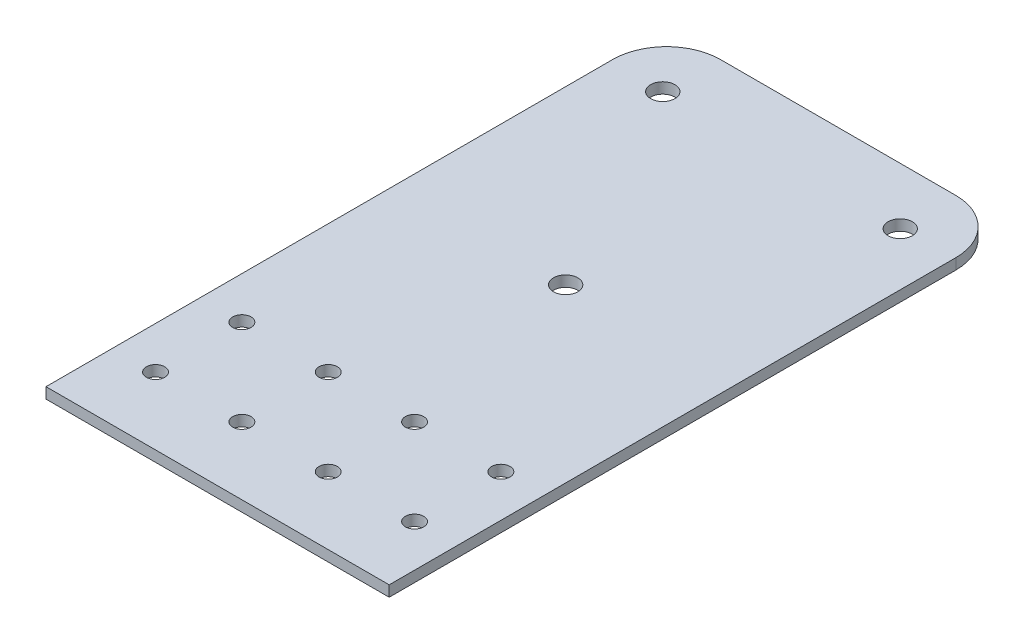
ISO-10303-21;
HEADER;
FILE_DESCRIPTION(('STEP AP214'),'2;1');
FILE_NAME('part.step','',(''),(''),'','','');
FILE_SCHEMA(('AUTOMOTIVE_DESIGN { 1 0 10303 214 1 1 1 1 }'));
ENDSEC;
DATA;
#1=APPLICATION_CONTEXT('core data for automotive mechanical design processes');
#2=APPLICATION_PROTOCOL_DEFINITION('international standard','automotive_design',2000,#1);
#3=PRODUCT_CONTEXT('',#1,'mechanical');
#4=PRODUCT('Part','Part','',(#3));
#5=PRODUCT_RELATED_PRODUCT_CATEGORY('part','',(#4));
#6=PRODUCT_DEFINITION_FORMATION('','',#4);
#7=PRODUCT_DEFINITION_CONTEXT('part definition',#1,'design');
#8=PRODUCT_DEFINITION('design','',#6,#7);
#9=PRODUCT_DEFINITION_SHAPE('','',#8);
#10=(LENGTH_UNIT() NAMED_UNIT(*) SI_UNIT(.MILLI.,.METRE.));
#11=(NAMED_UNIT(*) PLANE_ANGLE_UNIT() SI_UNIT($,.RADIAN.));
#12=(NAMED_UNIT(*) SI_UNIT($,.STERADIAN.) SOLID_ANGLE_UNIT());
#13=UNCERTAINTY_MEASURE_WITH_UNIT(LENGTH_MEASURE(1.E-05),#10,'distance_accuracy_value','');
#14=(GEOMETRIC_REPRESENTATION_CONTEXT(3) GLOBAL_UNCERTAINTY_ASSIGNED_CONTEXT((#13)) GLOBAL_UNIT_ASSIGNED_CONTEXT((#10,
#11,#12)) REPRESENTATION_CONTEXT('',''));
#15=CARTESIAN_POINT('',(0.,0.,0.));
#16=DIRECTION('',(0.,0.,1.));
#17=DIRECTION('',(1.,0.,0.));
#18=AXIS2_PLACEMENT_3D('',#15,#16,#17);
#19=CARTESIAN_POINT('',(31.8,0.,0.));
#20=DIRECTION('',(0.,0.,1.));
#21=DIRECTION('',(1.,0.,0.));
#22=AXIS2_PLACEMENT_3D('',#19,#20,#21);
#23=PLANE('',#22);
#24=DIRECTION('',(-1.,0.,0.));
#25=VECTOR('',#24,1.);
#26=CARTESIAN_POINT('',(31.8,2.,0.));
#27=LINE('',#26,#25);
#28=CARTESIAN_POINT('',(21.8,2.,0.));
#29=VERTEX_POINT('',#28);
#30=CARTESIAN_POINT('',(-21.8,2.,0.));
#31=VERTEX_POINT('',#30);
#32=EDGE_CURVE('E109',#29,#31,#27,.T.);
#33=ORIENTED_EDGE('',*,*,#32,.F.);
#34=DIRECTION('',(0.,1.,0.));
#35=VECTOR('',#34,1.);
#36=CARTESIAN_POINT('',(21.8,0.,0.));
#37=LINE('',#36,#35);
#38=CARTESIAN_POINT('',(21.8,0.,0.));
#39=VERTEX_POINT('',#38);
#40=EDGE_CURVE('E141',#29,#39,#37,.F.);
#41=ORIENTED_EDGE('',*,*,#40,.T.);
#42=DIRECTION('',(-1.,0.,0.));
#43=VECTOR('',#42,1.);
#44=CARTESIAN_POINT('',(31.8,0.,0.));
#45=LINE('',#44,#43);
#46=CARTESIAN_POINT('',(-21.8,0.,0.));
#47=VERTEX_POINT('',#46);
#48=EDGE_CURVE('E126',#39,#47,#45,.T.);
#49=ORIENTED_EDGE('',*,*,#48,.T.);
#50=DIRECTION('',(0.,1.,0.));
#51=VECTOR('',#50,1.);
#52=CARTESIAN_POINT('',(-21.8,0.,0.));
#53=LINE('',#52,#51);
#54=EDGE_CURVE('E138',#47,#31,#53,.T.);
#55=ORIENTED_EDGE('',*,*,#54,.T.);
#56=EDGE_LOOP('',(#33,#41,#49,#55));
#57=FACE_BOUND('',#56,.T.);
#58=ADVANCED_FACE('F36',(#57),#23,.F.);
#59=CARTESIAN_POINT('',(31.8,1.99999999999999,55.));
#60=DIRECTION('',(0.,-1.,0.));
#61=DIRECTION('',(0.,0.,-1.));
#62=AXIS2_PLACEMENT_3D('',#59,#60,#61);
#63=PLANE('',#62);
#64=CARTESIAN_POINT('',(0.,1.99999999999999,50.5));
#65=DIRECTION('',(0.,1.,0.));
#66=DIRECTION('',(0.,0.,1.));
#67=AXIS2_PLACEMENT_3D('',#64,#65,#66);
#68=CIRCLE('',#67,2.25);
#69=CARTESIAN_POINT('',(0.,1.99999999999999,52.75));
#70=VERTEX_POINT('',#69);
#71=EDGE_CURVE('E310',#70,#70,#68,.T.);
#72=ORIENTED_EDGE('',*,*,#71,.F.);
#73=EDGE_LOOP('',(#72));
#74=FACE_BOUND('',#73,.T.);
#75=CARTESIAN_POINT('',(22.,2.,10.5));
#76=DIRECTION('',(0.,1.,0.));
#77=DIRECTION('',(0.,0.,1.));
#78=AXIS2_PLACEMENT_3D('',#75,#76,#77);
#79=CIRCLE('',#78,2.25);
#80=CARTESIAN_POINT('',(22.,2.,12.75));
#81=VERTEX_POINT('',#80);
#82=EDGE_CURVE('E132',#81,#81,#79,.T.);
#83=ORIENTED_EDGE('',*,*,#82,.F.);
#84=EDGE_LOOP('',(#83));
#85=FACE_BOUND('',#84,.T.);
#86=CARTESIAN_POINT('',(-22.,2.,10.5));
#87=DIRECTION('',(0.,1.,0.));
#88=DIRECTION('',(0.,0.,1.));
#89=AXIS2_PLACEMENT_3D('',#86,#87,#88);
#90=CIRCLE('',#89,2.25);
#91=CARTESIAN_POINT('',(-22.,2.,12.75));
#92=VERTEX_POINT('',#91);
#93=EDGE_CURVE('E131',#92,#92,#90,.T.);
#94=ORIENTED_EDGE('',*,*,#93,.F.);
#95=EDGE_LOOP('',(#94));
#96=FACE_BOUND('',#95,.T.);
#97=CARTESIAN_POINT('',(-24.,1.99999999999999,102.5));
#98=DIRECTION('',(0.,1.,0.));
#99=DIRECTION('',(0.,0.,1.));
#100=AXIS2_PLACEMENT_3D('',#97,#98,#99);
#101=CIRCLE('',#100,1.69999999999999);
#102=CARTESIAN_POINT('',(-24.,1.99999999999999,104.2));
#103=VERTEX_POINT('',#102);
#104=EDGE_CURVE('E301',#103,#103,#101,.T.);
#105=ORIENTED_EDGE('',*,*,#104,.F.);
#106=EDGE_LOOP('',(#105));
#107=FACE_BOUND('',#106,.T.);
#108=CARTESIAN_POINT('',(-24.,1.99999999999999,86.5));
#109=DIRECTION('',(0.,1.,0.));
#110=DIRECTION('',(0.,0.,1.));
#111=AXIS2_PLACEMENT_3D('',#108,#109,#110);
#112=CIRCLE('',#111,1.69999999999999);
#113=CARTESIAN_POINT('',(-24.,1.99999999999999,88.2));
#114=VERTEX_POINT('',#113);
#115=EDGE_CURVE('E297',#114,#114,#112,.T.);
#116=ORIENTED_EDGE('',*,*,#115,.F.);
#117=EDGE_LOOP('',(#116));
#118=FACE_BOUND('',#117,.T.);
#119=CARTESIAN_POINT('',(-8.,1.99999999999999,86.5));
#120=DIRECTION('',(0.,1.,0.));
#121=DIRECTION('',(0.,0.,1.));
#122=AXIS2_PLACEMENT_3D('',#119,#120,#121);
#123=CIRCLE('',#122,1.69999999999999);
#124=CARTESIAN_POINT('',(-8.,1.99999999999999,88.2));
#125=VERTEX_POINT('',#124);
#126=EDGE_CURVE('E293',#125,#125,#123,.T.);
#127=ORIENTED_EDGE('',*,*,#126,.F.);
#128=EDGE_LOOP('',(#127));
#129=FACE_BOUND('',#128,.T.);
#130=CARTESIAN_POINT('',(-8.,1.99999999999999,102.5));
#131=DIRECTION('',(0.,1.,0.));
#132=DIRECTION('',(0.,0.,1.));
#133=AXIS2_PLACEMENT_3D('',#130,#131,#132);
#134=CIRCLE('',#133,1.69999999999999);
#135=CARTESIAN_POINT('',(-8.,1.99999999999999,104.2));
#136=VERTEX_POINT('',#135);
#137=EDGE_CURVE('E289',#136,#136,#134,.T.);
#138=ORIENTED_EDGE('',*,*,#137,.F.);
#139=EDGE_LOOP('',(#138));
#140=FACE_BOUND('',#139,.T.);
#141=CARTESIAN_POINT('',(24.,1.99999999999999,102.5));
#142=DIRECTION('',(0.,1.,0.));
#143=DIRECTION('',(0.,0.,1.));
#144=AXIS2_PLACEMENT_3D('',#141,#142,#143);
#145=CIRCLE('',#144,1.69999999999999);
#146=CARTESIAN_POINT('',(24.,1.99999999999999,104.2));
#147=VERTEX_POINT('',#146);
#148=EDGE_CURVE('E285',#147,#147,#145,.T.);
#149=ORIENTED_EDGE('',*,*,#148,.F.);
#150=EDGE_LOOP('',(#149));
#151=FACE_BOUND('',#150,.T.);
#152=CARTESIAN_POINT('',(8.,1.99999999999999,102.5));
#153=DIRECTION('',(0.,1.,0.));
#154=DIRECTION('',(0.,0.,1.));
#155=AXIS2_PLACEMENT_3D('',#152,#153,#154);
#156=CIRCLE('',#155,1.69999999999999);
#157=CARTESIAN_POINT('',(8.,1.99999999999999,104.2));
#158=VERTEX_POINT('',#157);
#159=EDGE_CURVE('E280',#158,#158,#156,.T.);
#160=ORIENTED_EDGE('',*,*,#159,.F.);
#161=EDGE_LOOP('',(#160));
#162=FACE_BOUND('',#161,.T.);
#163=CARTESIAN_POINT('',(8.,1.99999999999999,86.5));
#164=DIRECTION('',(0.,1.,0.));
#165=DIRECTION('',(0.,0.,1.));
#166=AXIS2_PLACEMENT_3D('',#163,#164,#165);
#167=CIRCLE('',#166,1.69999999999999);
#168=CARTESIAN_POINT('',(8.,1.99999999999999,88.2));
#169=VERTEX_POINT('',#168);
#170=EDGE_CURVE('E225',#169,#169,#167,.T.);
#171=ORIENTED_EDGE('',*,*,#170,.F.);
#172=EDGE_LOOP('',(#171));
#173=FACE_BOUND('',#172,.T.);
#174=CARTESIAN_POINT('',(24.,1.99999999999999,86.5));
#175=DIRECTION('',(0.,1.,0.));
#176=DIRECTION('',(0.,0.,1.));
#177=AXIS2_PLACEMENT_3D('',#174,#175,#176);
#178=CIRCLE('',#177,1.69999999999999);
#179=CARTESIAN_POINT('',(24.,1.99999999999999,88.2));
#180=VERTEX_POINT('',#179);
#181=EDGE_CURVE('E230',#180,#180,#178,.T.);
#182=ORIENTED_EDGE('',*,*,#181,.F.);
#183=EDGE_LOOP('',(#182));
#184=FACE_BOUND('',#183,.T.);
#185=DIRECTION('',(0.,0.,1.));
#186=VECTOR('',#185,1.);
#187=CARTESIAN_POINT('',(31.8,2.,0.));
#188=LINE('',#187,#186);
#189=CARTESIAN_POINT('',(31.8,2.,10.));
#190=VERTEX_POINT('',#189);
#191=CARTESIAN_POINT('',(31.8,1.99999999999999,115.));
#192=VERTEX_POINT('',#191);
#193=EDGE_CURVE('E90',#190,#192,#188,.T.);
#194=ORIENTED_EDGE('',*,*,#193,.F.);
#195=CARTESIAN_POINT('',(21.8,2.,10.));
#196=DIRECTION('',(0.,-1.,0.));
#197=DIRECTION('',(0.,0.,-1.));
#198=AXIS2_PLACEMENT_3D('',#195,#196,#197);
#199=CIRCLE('',#198,10.);
#200=EDGE_CURVE('E136',#190,#29,#199,.F.);
#201=ORIENTED_EDGE('',*,*,#200,.T.);
#202=ORIENTED_EDGE('',*,*,#32,.T.);
#203=CARTESIAN_POINT('',(-21.8,2.,10.));
#204=DIRECTION('',(0.,-1.,0.));
#205=DIRECTION('',(0.,0.,-1.));
#206=AXIS2_PLACEMENT_3D('',#203,#204,#205);
#207=CIRCLE('',#206,10.);
#208=CARTESIAN_POINT('',(-31.8,2.,10.));
#209=VERTEX_POINT('',#208);
#210=EDGE_CURVE('E134',#31,#209,#207,.F.);
#211=ORIENTED_EDGE('',*,*,#210,.T.);
#212=DIRECTION('',(0.,0.,1.));
#213=VECTOR('',#212,1.);
#214=CARTESIAN_POINT('',(-31.8,1.99999999999999,55.));
#215=LINE('',#214,#213);
#216=CARTESIAN_POINT('',(-31.8,1.99999999999999,115.));
#217=VERTEX_POINT('',#216);
#218=EDGE_CURVE('E105',#209,#217,#215,.T.);
#219=ORIENTED_EDGE('',*,*,#218,.T.);
#220=DIRECTION('',(-1.,0.,0.));
#221=VECTOR('',#220,1.);
#222=CARTESIAN_POINT('',(31.8,1.99999999999999,115.));
#223=LINE('',#222,#221);
#224=EDGE_CURVE('E103',#192,#217,#223,.T.);
#225=ORIENTED_EDGE('',*,*,#224,.F.);
#226=EDGE_LOOP('',(#194,#201,#202,#211,#219,#225));
#227=FACE_BOUND('',#226,.T.);
#228=ADVANCED_FACE('F104',(#74,#85,#96,#107,#118,#129,#140,#151,#162,#173,#184,#227),#63,.F.);
#229=CARTESIAN_POINT('',(31.8,1.99999999999999,115.));
#230=DIRECTION('',(0.,0.,-1.));
#231=DIRECTION('',(-1.,0.,0.));
#232=AXIS2_PLACEMENT_3D('',#229,#230,#231);
#233=PLANE('',#232);
#234=DIRECTION('',(0.,-1.,0.));
#235=VECTOR('',#234,1.);
#236=CARTESIAN_POINT('',(-31.8,1.99999999999999,115.));
#237=LINE('',#236,#235);
#238=CARTESIAN_POINT('',(-31.8,0.,115.));
#239=VERTEX_POINT('',#238);
#240=EDGE_CURVE('E119',#217,#239,#237,.T.);
#241=ORIENTED_EDGE('',*,*,#240,.T.);
#242=DIRECTION('',(-1.,0.,0.));
#243=VECTOR('',#242,1.);
#244=CARTESIAN_POINT('',(31.8,0.,115.));
#245=LINE('',#244,#243);
#246=CARTESIAN_POINT('',(31.8,0.,115.));
#247=VERTEX_POINT('',#246);
#248=EDGE_CURVE('E110',#247,#239,#245,.T.);
#249=ORIENTED_EDGE('',*,*,#248,.F.);
#250=DIRECTION('',(0.,-1.,0.));
#251=VECTOR('',#250,1.);
#252=CARTESIAN_POINT('',(31.8,1.99999999999999,115.));
#253=LINE('',#252,#251);
#254=EDGE_CURVE('E95',#192,#247,#253,.T.);
#255=ORIENTED_EDGE('',*,*,#254,.F.);
#256=ORIENTED_EDGE('',*,*,#224,.T.);
#257=EDGE_LOOP('',(#241,#249,#255,#256));
#258=FACE_BOUND('',#257,.T.);
#259=ADVANCED_FACE('F112',(#258),#233,.F.);
#260=CARTESIAN_POINT('',(31.8,0.,35.));
#261=DIRECTION('',(0.,1.,0.));
#262=DIRECTION('',(0.,0.,1.));
#263=AXIS2_PLACEMENT_3D('',#260,#261,#262);
#264=PLANE('',#263);
#265=CARTESIAN_POINT('',(0.,0.,50.5));
#266=DIRECTION('',(0.,1.,0.));
#267=DIRECTION('',(0.,0.,1.));
#268=AXIS2_PLACEMENT_3D('',#265,#266,#267);
#269=CIRCLE('',#268,2.25);
#270=CARTESIAN_POINT('',(0.,0.,52.75));
#271=VERTEX_POINT('',#270);
#272=EDGE_CURVE('E250',#271,#271,#269,.T.);
#273=ORIENTED_EDGE('',*,*,#272,.T.);
#274=EDGE_LOOP('',(#273));
#275=FACE_BOUND('',#274,.T.);
#276=CARTESIAN_POINT('',(22.,0.,10.5));
#277=DIRECTION('',(0.,1.,0.));
#278=DIRECTION('',(0.,0.,1.));
#279=AXIS2_PLACEMENT_3D('',#276,#277,#278);
#280=CIRCLE('',#279,2.25);
#281=CARTESIAN_POINT('',(22.,0.,12.75));
#282=VERTEX_POINT('',#281);
#283=EDGE_CURVE('E128',#282,#282,#280,.T.);
#284=ORIENTED_EDGE('',*,*,#283,.T.);
#285=EDGE_LOOP('',(#284));
#286=FACE_BOUND('',#285,.T.);
#287=CARTESIAN_POINT('',(-22.,0.,10.5));
#288=DIRECTION('',(0.,1.,0.));
#289=DIRECTION('',(0.,0.,1.));
#290=AXIS2_PLACEMENT_3D('',#287,#288,#289);
#291=CIRCLE('',#290,2.25);
#292=CARTESIAN_POINT('',(-22.,0.,12.75));
#293=VERTEX_POINT('',#292);
#294=EDGE_CURVE('E256',#293,#293,#291,.T.);
#295=ORIENTED_EDGE('',*,*,#294,.T.);
#296=EDGE_LOOP('',(#295));
#297=FACE_BOUND('',#296,.T.);
#298=CARTESIAN_POINT('',(-24.,0.,102.5));
#299=DIRECTION('',(0.,1.,0.));
#300=DIRECTION('',(0.,0.,1.));
#301=AXIS2_PLACEMENT_3D('',#298,#299,#300);
#302=CIRCLE('',#301,1.69999999999999);
#303=CARTESIAN_POINT('',(-24.,0.,104.2));
#304=VERTEX_POINT('',#303);
#305=EDGE_CURVE('E260',#304,#304,#302,.T.);
#306=ORIENTED_EDGE('',*,*,#305,.T.);
#307=EDGE_LOOP('',(#306));
#308=FACE_BOUND('',#307,.T.);
#309=CARTESIAN_POINT('',(-24.,0.,86.5));
#310=DIRECTION('',(0.,1.,0.));
#311=DIRECTION('',(0.,0.,1.));
#312=AXIS2_PLACEMENT_3D('',#309,#310,#311);
#313=CIRCLE('',#312,1.69999999999999);
#314=CARTESIAN_POINT('',(-24.,0.,88.2));
#315=VERTEX_POINT('',#314);
#316=EDGE_CURVE('E264',#315,#315,#313,.T.);
#317=ORIENTED_EDGE('',*,*,#316,.T.);
#318=EDGE_LOOP('',(#317));
#319=FACE_BOUND('',#318,.T.);
#320=CARTESIAN_POINT('',(-8.,0.,86.5));
#321=DIRECTION('',(0.,1.,0.));
#322=DIRECTION('',(0.,0.,1.));
#323=AXIS2_PLACEMENT_3D('',#320,#321,#322);
#324=CIRCLE('',#323,1.69999999999999);
#325=CARTESIAN_POINT('',(-8.,0.,88.2));
#326=VERTEX_POINT('',#325);
#327=EDGE_CURVE('E268',#326,#326,#324,.T.);
#328=ORIENTED_EDGE('',*,*,#327,.T.);
#329=EDGE_LOOP('',(#328));
#330=FACE_BOUND('',#329,.T.);
#331=CARTESIAN_POINT('',(-8.,0.,102.5));
#332=DIRECTION('',(0.,1.,0.));
#333=DIRECTION('',(0.,0.,1.));
#334=AXIS2_PLACEMENT_3D('',#331,#332,#333);
#335=CIRCLE('',#334,1.69999999999999);
#336=CARTESIAN_POINT('',(-8.,0.,104.2));
#337=VERTEX_POINT('',#336);
#338=EDGE_CURVE('E272',#337,#337,#335,.T.);
#339=ORIENTED_EDGE('',*,*,#338,.T.);
#340=EDGE_LOOP('',(#339));
#341=FACE_BOUND('',#340,.T.);
#342=CARTESIAN_POINT('',(24.,0.,102.5));
#343=DIRECTION('',(0.,1.,0.));
#344=DIRECTION('',(0.,0.,1.));
#345=AXIS2_PLACEMENT_3D('',#342,#343,#344);
#346=CIRCLE('',#345,1.69999999999999);
#347=CARTESIAN_POINT('',(24.,0.,104.2));
#348=VERTEX_POINT('',#347);
#349=EDGE_CURVE('E276',#348,#348,#346,.T.);
#350=ORIENTED_EDGE('',*,*,#349,.T.);
#351=EDGE_LOOP('',(#350));
#352=FACE_BOUND('',#351,.T.);
#353=CARTESIAN_POINT('',(8.,0.,102.5));
#354=DIRECTION('',(0.,1.,0.));
#355=DIRECTION('',(0.,0.,1.));
#356=AXIS2_PLACEMENT_3D('',#353,#354,#355);
#357=CIRCLE('',#356,1.69999999999999);
#358=CARTESIAN_POINT('',(8.,0.,104.2));
#359=VERTEX_POINT('',#358);
#360=EDGE_CURVE('E234',#359,#359,#357,.T.);
#361=ORIENTED_EDGE('',*,*,#360,.T.);
#362=EDGE_LOOP('',(#361));
#363=FACE_BOUND('',#362,.T.);
#364=CARTESIAN_POINT('',(8.,0.,86.5));
#365=DIRECTION('',(0.,1.,0.));
#366=DIRECTION('',(0.,0.,1.));
#367=AXIS2_PLACEMENT_3D('',#364,#365,#366);
#368=CIRCLE('',#367,1.69999999999999);
#369=CARTESIAN_POINT('',(8.,0.,88.2));
#370=VERTEX_POINT('',#369);
#371=EDGE_CURVE('E228',#370,#370,#368,.T.);
#372=ORIENTED_EDGE('',*,*,#371,.T.);
#373=EDGE_LOOP('',(#372));
#374=FACE_BOUND('',#373,.T.);
#375=CARTESIAN_POINT('',(24.,0.,86.5));
#376=DIRECTION('',(0.,1.,0.));
#377=DIRECTION('',(0.,0.,1.));
#378=AXIS2_PLACEMENT_3D('',#375,#376,#377);
#379=CIRCLE('',#378,1.69999999999999);
#380=CARTESIAN_POINT('',(24.,0.,88.2));
#381=VERTEX_POINT('',#380);
#382=EDGE_CURVE('E120',#381,#381,#379,.T.);
#383=ORIENTED_EDGE('',*,*,#382,.T.);
#384=EDGE_LOOP('',(#383));
#385=FACE_BOUND('',#384,.T.);
#386=ORIENTED_EDGE('',*,*,#48,.F.);
#387=CARTESIAN_POINT('',(21.8,0.,10.));
#388=DIRECTION('',(0.,1.,0.));
#389=DIRECTION('',(0.,0.,1.));
#390=AXIS2_PLACEMENT_3D('',#387,#388,#389);
#391=CIRCLE('',#390,10.);
#392=CARTESIAN_POINT('',(31.8,0.,10.));
#393=VERTEX_POINT('',#392);
#394=EDGE_CURVE('E44',#39,#393,#391,.F.);
#395=ORIENTED_EDGE('',*,*,#394,.T.);
#396=DIRECTION('',(0.,0.,-1.));
#397=VECTOR('',#396,1.);
#398=CARTESIAN_POINT('',(31.8,0.,0.));
#399=LINE('',#398,#397);
#400=EDGE_CURVE('E100',#247,#393,#399,.T.);
#401=ORIENTED_EDGE('',*,*,#400,.F.);
#402=ORIENTED_EDGE('',*,*,#248,.T.);
#403=DIRECTION('',(0.,0.,-1.));
#404=VECTOR('',#403,1.);
#405=CARTESIAN_POINT('',(-31.8,0.,35.));
#406=LINE('',#405,#404);
#407=CARTESIAN_POINT('',(-31.8,0.,10.));
#408=VERTEX_POINT('',#407);
#409=EDGE_CURVE('E122',#239,#408,#406,.T.);
#410=ORIENTED_EDGE('',*,*,#409,.T.);
#411=CARTESIAN_POINT('',(-21.8,0.,10.));
#412=DIRECTION('',(0.,1.,0.));
#413=DIRECTION('',(0.,0.,1.));
#414=AXIS2_PLACEMENT_3D('',#411,#412,#413);
#415=CIRCLE('',#414,10.);
#416=EDGE_CURVE('E56',#408,#47,#415,.F.);
#417=ORIENTED_EDGE('',*,*,#416,.T.);
#418=EDGE_LOOP('',(#386,#395,#401,#402,#410,#417));
#419=FACE_BOUND('',#418,.T.);
#420=ADVANCED_FACE('F144',(#275,#286,#297,#308,#319,#330,#341,#352,#363,#374,#385,#419),#264,.F.);
#421=CARTESIAN_POINT('',(31.8,0.,0.));
#422=DIRECTION('',(1.,0.,0.));
#423=DIRECTION('',(0.,0.,-1.));
#424=AXIS2_PLACEMENT_3D('',#421,#422,#423);
#425=PLANE('',#424);
#426=ORIENTED_EDGE('',*,*,#400,.T.);
#427=DIRECTION('',(0.,1.,0.));
#428=VECTOR('',#427,1.);
#429=CARTESIAN_POINT('',(31.8,2.,10.));
#430=LINE('',#429,#428);
#431=EDGE_CURVE('E98',#393,#190,#430,.T.);
#432=ORIENTED_EDGE('',*,*,#431,.T.);
#433=ORIENTED_EDGE('',*,*,#193,.T.);
#434=ORIENTED_EDGE('',*,*,#254,.T.);
#435=EDGE_LOOP('',(#426,#432,#433,#434));
#436=FACE_BOUND('',#435,.T.);
#437=ADVANCED_FACE('F93',(#436),#425,.T.);
#438=CARTESIAN_POINT('',(-31.8,0.,0.));
#439=DIRECTION('',(1.,0.,0.));
#440=DIRECTION('',(0.,0.,-1.));
#441=AXIS2_PLACEMENT_3D('',#438,#439,#440);
#442=PLANE('',#441);
#443=ORIENTED_EDGE('',*,*,#218,.F.);
#444=DIRECTION('',(0.,1.,0.));
#445=VECTOR('',#444,1.);
#446=CARTESIAN_POINT('',(-31.8,0.,10.));
#447=LINE('',#446,#445);
#448=EDGE_CURVE('E11',#209,#408,#447,.F.);
#449=ORIENTED_EDGE('',*,*,#448,.T.);
#450=ORIENTED_EDGE('',*,*,#409,.F.);
#451=ORIENTED_EDGE('',*,*,#240,.F.);
#452=EDGE_LOOP('',(#443,#449,#450,#451));
#453=FACE_BOUND('',#452,.T.);
#454=ADVANCED_FACE('F152',(#453),#442,.F.);
#455=CARTESIAN_POINT('',(24.,1.99999999999999,86.5));
#456=DIRECTION('',(0.,1.,0.));
#457=DIRECTION('',(0.,0.,1.));
#458=AXIS2_PLACEMENT_3D('',#455,#456,#457);
#459=CYLINDRICAL_SURFACE('',#458,1.69999999999999);
#460=ORIENTED_EDGE('',*,*,#181,.T.);
#461=EDGE_LOOP('',(#460));
#462=FACE_BOUND('',#461,.T.);
#463=ORIENTED_EDGE('',*,*,#382,.F.);
#464=EDGE_LOOP('',(#463));
#465=FACE_BOUND('',#464,.T.);
#466=ADVANCED_FACE('F154',(#462,#465),#459,.F.);
#467=CARTESIAN_POINT('',(8.,1.99999999999999,86.5));
#468=DIRECTION('',(0.,1.,0.));
#469=DIRECTION('',(0.,0.,1.));
#470=AXIS2_PLACEMENT_3D('',#467,#468,#469);
#471=CYLINDRICAL_SURFACE('',#470,1.69999999999999);
#472=ORIENTED_EDGE('',*,*,#170,.T.);
#473=EDGE_LOOP('',(#472));
#474=FACE_BOUND('',#473,.T.);
#475=ORIENTED_EDGE('',*,*,#371,.F.);
#476=EDGE_LOOP('',(#475));
#477=FACE_BOUND('',#476,.T.);
#478=ADVANCED_FACE('F160',(#474,#477),#471,.F.);
#479=CARTESIAN_POINT('',(8.,1.99999999999999,102.5));
#480=DIRECTION('',(0.,1.,0.));
#481=DIRECTION('',(0.,0.,1.));
#482=AXIS2_PLACEMENT_3D('',#479,#480,#481);
#483=CYLINDRICAL_SURFACE('',#482,1.69999999999999);
#484=ORIENTED_EDGE('',*,*,#159,.T.);
#485=EDGE_LOOP('',(#484));
#486=FACE_BOUND('',#485,.T.);
#487=ORIENTED_EDGE('',*,*,#360,.F.);
#488=EDGE_LOOP('',(#487));
#489=FACE_BOUND('',#488,.T.);
#490=ADVANCED_FACE('F213',(#486,#489),#483,.F.);
#491=CARTESIAN_POINT('',(24.,1.99999999999999,102.5));
#492=DIRECTION('',(0.,1.,0.));
#493=DIRECTION('',(0.,0.,1.));
#494=AXIS2_PLACEMENT_3D('',#491,#492,#493);
#495=CYLINDRICAL_SURFACE('',#494,1.69999999999999);
#496=ORIENTED_EDGE('',*,*,#148,.T.);
#497=EDGE_LOOP('',(#496));
#498=FACE_BOUND('',#497,.T.);
#499=ORIENTED_EDGE('',*,*,#349,.F.);
#500=EDGE_LOOP('',(#499));
#501=FACE_BOUND('',#500,.T.);
#502=ADVANCED_FACE('F209',(#498,#501),#495,.F.);
#503=CARTESIAN_POINT('',(-8.,1.99999999999999,102.5));
#504=DIRECTION('',(0.,1.,0.));
#505=DIRECTION('',(0.,0.,1.));
#506=AXIS2_PLACEMENT_3D('',#503,#504,#505);
#507=CYLINDRICAL_SURFACE('',#506,1.69999999999999);
#508=ORIENTED_EDGE('',*,*,#137,.T.);
#509=EDGE_LOOP('',(#508));
#510=FACE_BOUND('',#509,.T.);
#511=ORIENTED_EDGE('',*,*,#338,.F.);
#512=EDGE_LOOP('',(#511));
#513=FACE_BOUND('',#512,.T.);
#514=ADVANCED_FACE('F205',(#510,#513),#507,.F.);
#515=CARTESIAN_POINT('',(-8.,1.99999999999999,86.5));
#516=DIRECTION('',(0.,1.,0.));
#517=DIRECTION('',(0.,0.,1.));
#518=AXIS2_PLACEMENT_3D('',#515,#516,#517);
#519=CYLINDRICAL_SURFACE('',#518,1.69999999999999);
#520=ORIENTED_EDGE('',*,*,#126,.T.);
#521=EDGE_LOOP('',(#520));
#522=FACE_BOUND('',#521,.T.);
#523=ORIENTED_EDGE('',*,*,#327,.F.);
#524=EDGE_LOOP('',(#523));
#525=FACE_BOUND('',#524,.T.);
#526=ADVANCED_FACE('F201',(#522,#525),#519,.F.);
#527=CARTESIAN_POINT('',(-24.,1.99999999999999,86.5));
#528=DIRECTION('',(0.,1.,0.));
#529=DIRECTION('',(0.,0.,1.));
#530=AXIS2_PLACEMENT_3D('',#527,#528,#529);
#531=CYLINDRICAL_SURFACE('',#530,1.69999999999999);
#532=ORIENTED_EDGE('',*,*,#115,.T.);
#533=EDGE_LOOP('',(#532));
#534=FACE_BOUND('',#533,.T.);
#535=ORIENTED_EDGE('',*,*,#316,.F.);
#536=EDGE_LOOP('',(#535));
#537=FACE_BOUND('',#536,.T.);
#538=ADVANCED_FACE('F197',(#534,#537),#531,.F.);
#539=CARTESIAN_POINT('',(-24.,1.99999999999999,102.5));
#540=DIRECTION('',(0.,1.,0.));
#541=DIRECTION('',(0.,0.,1.));
#542=AXIS2_PLACEMENT_3D('',#539,#540,#541);
#543=CYLINDRICAL_SURFACE('',#542,1.69999999999999);
#544=ORIENTED_EDGE('',*,*,#104,.T.);
#545=EDGE_LOOP('',(#544));
#546=FACE_BOUND('',#545,.T.);
#547=ORIENTED_EDGE('',*,*,#305,.F.);
#548=EDGE_LOOP('',(#547));
#549=FACE_BOUND('',#548,.T.);
#550=ADVANCED_FACE('F193',(#546,#549),#543,.F.);
#551=CARTESIAN_POINT('',(-22.,2.,10.5));
#552=DIRECTION('',(0.,1.,0.));
#553=DIRECTION('',(0.,0.,1.));
#554=AXIS2_PLACEMENT_3D('',#551,#552,#553);
#555=CYLINDRICAL_SURFACE('',#554,2.25);
#556=ORIENTED_EDGE('',*,*,#93,.T.);
#557=EDGE_LOOP('',(#556));
#558=FACE_BOUND('',#557,.T.);
#559=ORIENTED_EDGE('',*,*,#294,.F.);
#560=EDGE_LOOP('',(#559));
#561=FACE_BOUND('',#560,.T.);
#562=ADVANCED_FACE('F185',(#558,#561),#555,.F.);
#563=CARTESIAN_POINT('',(22.,2.,10.5));
#564=DIRECTION('',(0.,1.,0.));
#565=DIRECTION('',(0.,0.,1.));
#566=AXIS2_PLACEMENT_3D('',#563,#564,#565);
#567=CYLINDRICAL_SURFACE('',#566,2.25);
#568=ORIENTED_EDGE('',*,*,#82,.T.);
#569=EDGE_LOOP('',(#568));
#570=FACE_BOUND('',#569,.T.);
#571=ORIENTED_EDGE('',*,*,#283,.F.);
#572=EDGE_LOOP('',(#571));
#573=FACE_BOUND('',#572,.T.);
#574=ADVANCED_FACE('F179',(#570,#573),#567,.F.);
#575=CARTESIAN_POINT('',(0.,1.99999999999999,50.5));
#576=DIRECTION('',(0.,1.,0.));
#577=DIRECTION('',(0.,0.,1.));
#578=AXIS2_PLACEMENT_3D('',#575,#576,#577);
#579=CYLINDRICAL_SURFACE('',#578,2.25);
#580=ORIENTED_EDGE('',*,*,#71,.T.);
#581=EDGE_LOOP('',(#580));
#582=FACE_BOUND('',#581,.T.);
#583=ORIENTED_EDGE('',*,*,#272,.F.);
#584=EDGE_LOOP('',(#583));
#585=FACE_BOUND('',#584,.T.);
#586=ADVANCED_FACE('F174',(#582,#585),#579,.F.);
#587=CARTESIAN_POINT('',(21.8,0.,10.));
#588=DIRECTION('',(0.,-1.,0.));
#589=DIRECTION('',(0.,0.,-1.));
#590=AXIS2_PLACEMENT_3D('',#587,#588,#589);
#591=CYLINDRICAL_SURFACE('',#590,10.);
#592=ORIENTED_EDGE('',*,*,#394,.F.);
#593=ORIENTED_EDGE('',*,*,#40,.F.);
#594=ORIENTED_EDGE('',*,*,#200,.F.);
#595=ORIENTED_EDGE('',*,*,#431,.F.);
#596=EDGE_LOOP('',(#592,#593,#594,#595));
#597=FACE_BOUND('',#596,.T.);
#598=ADVANCED_FACE('F147',(#597),#591,.T.);
#599=CARTESIAN_POINT('',(-21.8,0.,10.));
#600=DIRECTION('',(0.,1.,0.));
#601=DIRECTION('',(0.,0.,1.));
#602=AXIS2_PLACEMENT_3D('',#599,#600,#601);
#603=CYLINDRICAL_SURFACE('',#602,10.);
#604=ORIENTED_EDGE('',*,*,#416,.F.);
#605=ORIENTED_EDGE('',*,*,#448,.F.);
#606=ORIENTED_EDGE('',*,*,#210,.F.);
#607=ORIENTED_EDGE('',*,*,#54,.F.);
#608=EDGE_LOOP('',(#604,#605,#606,#607));
#609=FACE_BOUND('',#608,.T.);
#610=ADVANCED_FACE('F38',(#609),#603,.T.);
#611=CLOSED_SHELL('',(#58,#228,#259,#420,#437,#454,#466,#478,#490,#502,#514,#526,#538,#550,#562,
#574,#586,#598,#610));
#612=MANIFOLD_SOLID_BREP('B2',#611);
#613=ADVANCED_BREP_SHAPE_REPRESENTATION('',(#18,#612),#14);
#614=SHAPE_DEFINITION_REPRESENTATION(#9,#613);
ENDSEC;
END-ISO-10303-21;
